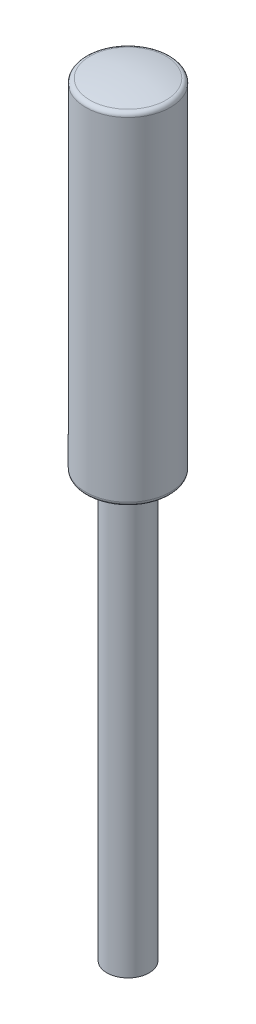
ISO-10303-21;
HEADER;
FILE_DESCRIPTION(('STEP AP214'),'2;1');
FILE_NAME('part.step','',(''),(''),'','','');
FILE_SCHEMA(('AUTOMOTIVE_DESIGN { 1 0 10303 214 1 1 1 1 }'));
ENDSEC;
DATA;
#1=APPLICATION_CONTEXT('core data for automotive mechanical design processes');
#2=APPLICATION_PROTOCOL_DEFINITION('international standard','automotive_design',2000,#1);
#3=PRODUCT_CONTEXT('',#1,'mechanical');
#4=PRODUCT('Part','Part','',(#3));
#5=PRODUCT_RELATED_PRODUCT_CATEGORY('part','',(#4));
#6=PRODUCT_DEFINITION_FORMATION('','',#4);
#7=PRODUCT_DEFINITION_CONTEXT('part definition',#1,'design');
#8=PRODUCT_DEFINITION('design','',#6,#7);
#9=PRODUCT_DEFINITION_SHAPE('','',#8);
#10=(LENGTH_UNIT() NAMED_UNIT(*) SI_UNIT(.MILLI.,.METRE.));
#11=(NAMED_UNIT(*) PLANE_ANGLE_UNIT() SI_UNIT($,.RADIAN.));
#12=(NAMED_UNIT(*) SI_UNIT($,.STERADIAN.) SOLID_ANGLE_UNIT());
#13=UNCERTAINTY_MEASURE_WITH_UNIT(LENGTH_MEASURE(1.E-05),#10,'distance_accuracy_value','');
#14=(GEOMETRIC_REPRESENTATION_CONTEXT(3) GLOBAL_UNCERTAINTY_ASSIGNED_CONTEXT((#13)) GLOBAL_UNIT_ASSIGNED_CONTEXT((#10,
#11,#12)) REPRESENTATION_CONTEXT('',''));
#15=CARTESIAN_POINT('',(0.,0.,0.));
#16=DIRECTION('',(0.,0.,1.));
#17=DIRECTION('',(1.,0.,0.));
#18=AXIS2_PLACEMENT_3D('',#15,#16,#17);
#19=CARTESIAN_POINT('',(0.,-20.,0.));
#20=DIRECTION('',(0.,0.,1.));
#21=DIRECTION('',(1.,0.,0.));
#22=AXIS2_PLACEMENT_3D('',#19,#20,#21);
#23=SPHERICAL_SURFACE('',#22,20.5);
#24=CARTESIAN_POINT('',(0.,-20.,0.));
#25=DIRECTION('',(0.,1.,0.));
#26=DIRECTION('',(0.,0.,1.));
#27=AXIS2_PLACEMENT_3D('',#24,#25,#26);
#28=SPHERICAL_SURFACE('',#27,20.5);
#29=CARTESIAN_POINT('',(0.,0.,0.));
#30=DIRECTION('',(0.,1.,0.));
#31=DIRECTION('',(0.,0.,1.));
#32=AXIS2_PLACEMENT_3D('',#29,#30,#31);
#33=CIRCLE('',#32,4.5);
#34=CARTESIAN_POINT('',(0.,0.,4.5));
#35=VERTEX_POINT('',#34);
#36=EDGE_CURVE('E10',#35,#35,#33,.T.);
#37=ORIENTED_EDGE('',*,*,#36,.T.);
#38=EDGE_LOOP('',(#37));
#39=FACE_BOUND('',#38,.T.);
#40=ADVANCED_FACE('F35',(#39),#28,.T.);
#41=CARTESIAN_POINT('',(0.,-90.4,0.));
#42=DIRECTION('',(0.,-1.,0.));
#43=DIRECTION('',(0.,0.,-1.));
#44=AXIS2_PLACEMENT_3D('',#41,#42,#43);
#45=CYLINDRICAL_SURFACE('',#44,5.);
#46=CARTESIAN_POINT('',(0.,-39.9,0.));
#47=DIRECTION('',(0.,-1.,0.));
#48=DIRECTION('',(0.,0.,-1.));
#49=AXIS2_PLACEMENT_3D('',#46,#47,#48);
#50=CIRCLE('',#49,5.);
#51=CARTESIAN_POINT('',(0.,-39.9,-5.));
#52=VERTEX_POINT('',#51);
#53=EDGE_CURVE('E41',#52,#52,#50,.F.);
#54=ORIENTED_EDGE('',*,*,#53,.T.);
#55=EDGE_LOOP('',(#54));
#56=FACE_BOUND('',#55,.T.);
#57=CARTESIAN_POINT('',(0.,-0.5,0.));
#58=DIRECTION('',(0.,1.,0.));
#59=DIRECTION('',(0.,0.,1.));
#60=AXIS2_PLACEMENT_3D('',#57,#58,#59);
#61=CIRCLE('',#60,5.);
#62=CARTESIAN_POINT('',(0.,-0.5,5.));
#63=VERTEX_POINT('',#62);
#64=EDGE_CURVE('E45',#63,#63,#61,.F.);
#65=ORIENTED_EDGE('',*,*,#64,.T.);
#66=EDGE_LOOP('',(#65));
#67=FACE_BOUND('',#66,.T.);
#68=ADVANCED_FACE('F74',(#56,#67),#45,.T.);
#69=CARTESIAN_POINT('',(5.00000000000001,-40.4,0.));
#70=DIRECTION('',(0.,-1.,0.));
#71=DIRECTION('',(0.,0.,-1.));
#72=AXIS2_PLACEMENT_3D('',#69,#70,#71);
#73=PLANE('',#72);
#74=CARTESIAN_POINT('',(0.,-40.4,0.));
#75=DIRECTION('',(0.,-1.,0.));
#76=DIRECTION('',(0.,0.,-1.));
#77=AXIS2_PLACEMENT_3D('',#74,#75,#76);
#78=CIRCLE('',#77,4.5);
#79=CARTESIAN_POINT('',(0.,-40.4,-4.5));
#80=VERTEX_POINT('',#79);
#81=EDGE_CURVE('E49',#80,#80,#78,.T.);
#82=ORIENTED_EDGE('',*,*,#81,.T.);
#83=EDGE_LOOP('',(#82));
#84=FACE_BOUND('',#83,.T.);
#85=CARTESIAN_POINT('',(0.,-40.4,0.));
#86=DIRECTION('',(0.,-1.,0.));
#87=DIRECTION('',(0.,0.,-1.));
#88=AXIS2_PLACEMENT_3D('',#85,#86,#87);
#89=CIRCLE('',#88,2.5);
#90=CARTESIAN_POINT('',(0.,-40.4,-2.5));
#91=VERTEX_POINT('',#90);
#92=EDGE_CURVE('E54',#91,#91,#89,.T.);
#93=ORIENTED_EDGE('',*,*,#92,.F.);
#94=EDGE_LOOP('',(#93));
#95=FACE_BOUND('',#94,.T.);
#96=ADVANCED_FACE('F65',(#84,#95),#73,.T.);
#97=CARTESIAN_POINT('',(0.,-90.4,0.));
#98=DIRECTION('',(0.,-1.,0.));
#99=DIRECTION('',(0.,0.,-1.));
#100=AXIS2_PLACEMENT_3D('',#97,#98,#99);
#101=CYLINDRICAL_SURFACE('',#100,2.5);
#102=ORIENTED_EDGE('',*,*,#92,.T.);
#103=EDGE_LOOP('',(#102));
#104=FACE_BOUND('',#103,.T.);
#105=CARTESIAN_POINT('',(0.,-90.4,0.));
#106=DIRECTION('',(0.,-1.,0.));
#107=DIRECTION('',(0.,0.,-1.));
#108=AXIS2_PLACEMENT_3D('',#105,#106,#107);
#109=CIRCLE('',#108,2.5);
#110=CARTESIAN_POINT('',(0.,-90.4,-2.5));
#111=VERTEX_POINT('',#110);
#112=EDGE_CURVE('E57',#111,#111,#109,.T.);
#113=ORIENTED_EDGE('',*,*,#112,.F.);
#114=EDGE_LOOP('',(#113));
#115=FACE_BOUND('',#114,.T.);
#116=ADVANCED_FACE('F63',(#104,#115),#101,.T.);
#117=CARTESIAN_POINT('',(2.5,-90.4,0.));
#118=DIRECTION('',(0.,-1.,0.));
#119=DIRECTION('',(0.,0.,-1.));
#120=AXIS2_PLACEMENT_3D('',#117,#118,#119);
#121=PLANE('',#120);
#122=ORIENTED_EDGE('',*,*,#112,.T.);
#123=EDGE_LOOP('',(#122));
#124=FACE_BOUND('',#123,.T.);
#125=ADVANCED_FACE('F61',(#124),#121,.T.);
#126=CARTESIAN_POINT('',(0.,-39.9,0.));
#127=DIRECTION('',(0.,-1.,0.));
#128=DIRECTION('',(0.,0.,-1.));
#129=AXIS2_PLACEMENT_3D('',#126,#127,#128);
#130=TOROIDAL_SURFACE('',#129,4.5,0.5);
#131=ORIENTED_EDGE('',*,*,#53,.F.);
#132=EDGE_LOOP('',(#131));
#133=FACE_BOUND('',#132,.T.);
#134=ORIENTED_EDGE('',*,*,#81,.F.);
#135=EDGE_LOOP('',(#134));
#136=FACE_BOUND('',#135,.T.);
#137=ADVANCED_FACE('F72',(#133,#136),#130,.T.);
#138=CARTESIAN_POINT('',(0.,-0.5,0.));
#139=DIRECTION('',(0.,1.,0.));
#140=DIRECTION('',(0.,0.,1.));
#141=AXIS2_PLACEMENT_3D('',#138,#139,#140);
#142=TOROIDAL_SURFACE('',#141,4.5,0.5);
#143=ORIENTED_EDGE('',*,*,#36,.F.);
#144=EDGE_LOOP('',(#143));
#145=FACE_BOUND('',#144,.T.);
#146=ORIENTED_EDGE('',*,*,#64,.F.);
#147=EDGE_LOOP('',(#146));
#148=FACE_BOUND('',#147,.T.);
#149=ADVANCED_FACE('F87',(#145,#148),#142,.T.);
#150=CLOSED_SHELL('',(#40,#68,#96,#116,#125,#137,#149));
#151=MANIFOLD_SOLID_BREP('B2',#150);
#152=ADVANCED_BREP_SHAPE_REPRESENTATION('',(#18,#151),#14);
#153=SHAPE_DEFINITION_REPRESENTATION(#9,#152);
ENDSEC;
END-ISO-10303-21;
